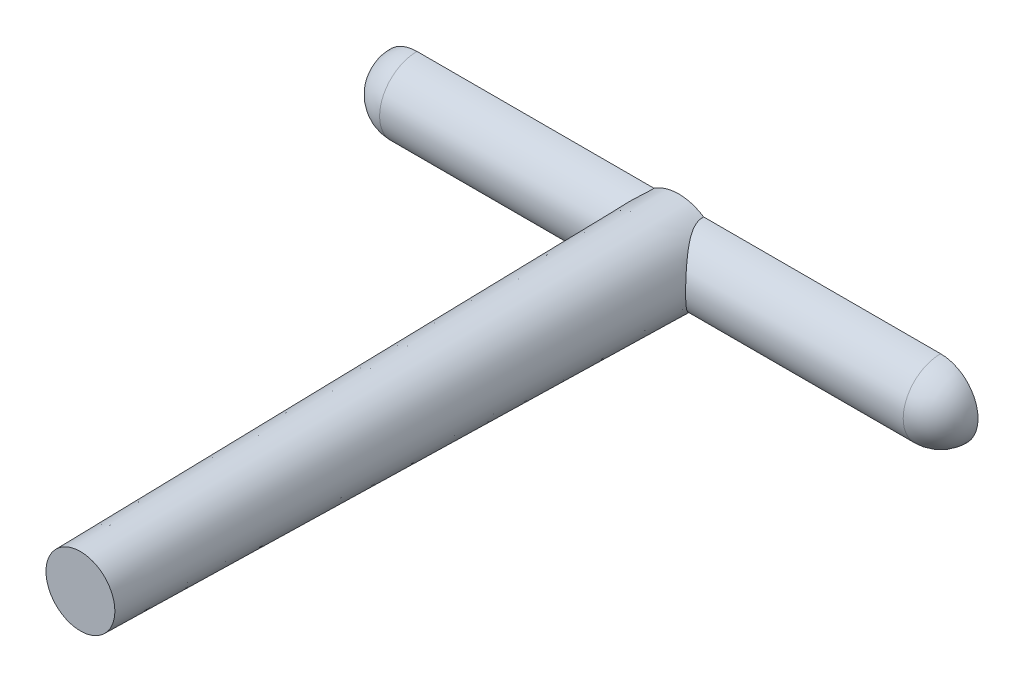
ISO-10303-21;
HEADER;
FILE_DESCRIPTION(('STEP AP214'),'2;1');
FILE_NAME('part.step','',(''),(''),'','','');
FILE_SCHEMA(('AUTOMOTIVE_DESIGN { 1 0 10303 214 1 1 1 1 }'));
ENDSEC;
DATA;
#1=APPLICATION_CONTEXT('core data for automotive mechanical design processes');
#2=APPLICATION_PROTOCOL_DEFINITION('international standard','automotive_design',2000,#1);
#3=PRODUCT_CONTEXT('',#1,'mechanical');
#4=PRODUCT('Part','Part','',(#3));
#5=PRODUCT_RELATED_PRODUCT_CATEGORY('part','',(#4));
#6=PRODUCT_DEFINITION_FORMATION('','',#4);
#7=PRODUCT_DEFINITION_CONTEXT('part definition',#1,'design');
#8=PRODUCT_DEFINITION('design','',#6,#7);
#9=PRODUCT_DEFINITION_SHAPE('','',#8);
#10=(LENGTH_UNIT() NAMED_UNIT(*) SI_UNIT(.MILLI.,.METRE.));
#11=(NAMED_UNIT(*) PLANE_ANGLE_UNIT() SI_UNIT($,.RADIAN.));
#12=(NAMED_UNIT(*) SI_UNIT($,.STERADIAN.) SOLID_ANGLE_UNIT());
#13=UNCERTAINTY_MEASURE_WITH_UNIT(LENGTH_MEASURE(1.E-05),#10,'distance_accuracy_value','');
#14=(GEOMETRIC_REPRESENTATION_CONTEXT(3) GLOBAL_UNCERTAINTY_ASSIGNED_CONTEXT((#13)) GLOBAL_UNIT_ASSIGNED_CONTEXT((#10,
#11,#12)) REPRESENTATION_CONTEXT('',''));
#15=CARTESIAN_POINT('',(0.,0.,0.));
#16=DIRECTION('',(0.,0.,1.));
#17=DIRECTION('',(1.,0.,0.));
#18=AXIS2_PLACEMENT_3D('',#15,#16,#17);
#19=CARTESIAN_POINT('',(-20.,0.,0.));
#20=DIRECTION('',(-1.,0.,0.));
#21=DIRECTION('',(0.,0.,1.));
#22=AXIS2_PLACEMENT_3D('',#19,#20,#21);
#23=CYLINDRICAL_SURFACE('',#22,2.5);
#24=DIRECTION('',(-1.,0.,0.));
#25=VECTOR('',#24,1.);
#26=CARTESIAN_POINT('',(-17.5,2.5,0.));
#27=LINE('',#26,#25);
#28=CARTESIAN_POINT('',(17.5,2.5,0.));
#29=VERTEX_POINT('',#28);
#30=CARTESIAN_POINT('',(1.6583123951777,2.5,0.));
#31=VERTEX_POINT('',#30);
#32=EDGE_CURVE('E87',#29,#31,#27,.T.);
#33=ORIENTED_EDGE('',*,*,#32,.T.);
#34=CARTESIAN_POINT('',(1.65831872270987,2.499999992,-0.000200000000008569));
#35=CARTESIAN_POINT('',(1.65691118249,2.50001367790751,0.0432280953647116));
#36=CARTESIAN_POINT('',(1.6572680105417,2.49887575801698,0.0866986855988901));
#37=CARTESIAN_POINT('',(1.66133995127769,2.49435998844086,0.17329522024137));
#38=CARTESIAN_POINT('',(1.66504949707968,2.49098585426137,0.216421616445954));
#39=CARTESIAN_POINT('',(1.67557460753311,2.48212646052389,0.301414449555393));
#40=CARTESIAN_POINT('',(1.68234351262531,2.47667310077305,0.343290088019334));
#41=CARTESIAN_POINT('',(1.69864828692563,2.46376197565381,0.426191073349026));
#42=CARTESIAN_POINT('',(1.70818543719791,2.45630328239289,0.467216017098571));
#43=CARTESIAN_POINT('',(1.74819791750787,2.42498377341643,0.618198648149621));
#44=CARTESIAN_POINT('',(1.78639727672917,2.39503553920176,0.724897365333699));
#45=CARTESIAN_POINT('',(1.87333411642033,2.32306936689233,0.930242509286194));
#46=CARTESIAN_POINT('',(1.92215514064034,2.28095482175718,1.02881602972014));
#47=CARTESIAN_POINT('',(2.01175982296458,2.19794688345456,1.19383419930235));
#48=CARTESIAN_POINT('',(2.05145221649262,2.15943992723876,1.26209814447758));
#49=CARTESIAN_POINT('',(2.13206522286415,2.07658836732887,1.39422719274052));
#50=CARTESIAN_POINT('',(2.17298640556665,2.03224102180182,1.458090208181));
#51=CARTESIAN_POINT('',(2.29551214072279,1.8907325793802,1.64292243148715));
#52=CARTESIAN_POINT('',(2.37709940614192,1.78491308172792,1.75751337482337));
#53=CARTESIAN_POINT('',(2.51776005886753,1.57201669479869,1.94813944408979));
#54=CARTESIAN_POINT('',(2.57822060181856,1.46871700479609,2.02739246784389));
#55=CARTESIAN_POINT('',(2.68951873970945,1.24734265076505,2.17058563244521));
#56=CARTESIAN_POINT('',(2.7403712338693,1.1292913423902,2.23454952370517));
#57=CARTESIAN_POINT('',(2.82027718493247,0.902750011902698,2.33397522564415));
#58=CARTESIAN_POINT('',(2.85161244641345,0.796418238795884,2.37250380106028));
#59=CARTESIAN_POINT('',(2.90285607376501,0.576939619557313,2.43518672846476));
#60=CARTESIAN_POINT('',(2.92277132286326,0.46379692414038,2.45934973938848));
#61=CARTESIAN_POINT('',(2.94958978318102,0.233171577968537,2.49183548251511));
#62=CARTESIAN_POINT('',(2.95643364806433,0.11567159073321,2.50008597077669));
#63=CARTESIAN_POINT('',(2.95628993477217,-0.119303831552891,2.49991271002276));
#64=CARTESIAN_POINT('',(2.94930377538985,-0.236779267885816,2.49149067140677));
#65=CARTESIAN_POINT('',(2.92315770351545,-0.459373811534688,2.45981622928826));
#66=CARTESIAN_POINT('',(2.90492381425137,-0.564768864279865,2.43769145737232));
#67=CARTESIAN_POINT('',(2.85847104219434,-0.769789227038972,2.38091360073576));
#68=CARTESIAN_POINT('',(2.83024948749581,-0.869412984805761,2.34625716348336));
#69=CARTESIAN_POINT('',(2.76300119186477,-1.06879945839087,2.26279926832524));
#70=CARTESIAN_POINT('',(2.72329711290839,-1.16795174649301,2.21309683717941));
#71=CARTESIAN_POINT('',(2.63663300693698,-1.3564903358799,2.10282626051992));
#72=CARTESIAN_POINT('',(2.58967042437517,-1.44587317858006,2.04225428688419));
#73=CARTESIAN_POINT('',(2.48068506226057,-1.63165737210345,1.89846678323049));
#74=CARTESIAN_POINT('',(2.41754413765634,-1.72577260834879,1.81315260002529));
#75=CARTESIAN_POINT('',(2.28794746955093,-1.89922848537495,1.63059059265366));
#76=CARTESIAN_POINT('',(2.22148625637457,-1.97854365475852,1.53332266415105));
#77=CARTESIAN_POINT('',(2.08895298151238,-2.12312279042065,1.32610667602634));
#78=CARTESIAN_POINT('',(2.02289825159191,-2.18818286499066,1.21600531990537));
#79=CARTESIAN_POINT('',(1.89867040107998,-2.30203515173958,0.983526981993171));
#80=CARTESIAN_POINT('',(1.84048066580649,-2.35086198554801,0.861176859053623));
#81=CARTESIAN_POINT('',(1.76111563078384,-2.41492846886666,0.652043012371417));
#82=CARTESIAN_POINT('',(1.7342532709581,-2.43589221653652,0.569214845551105));
#83=CARTESIAN_POINT('',(1.69144666063516,-2.46941126033992,0.39928828276785));
#84=CARTESIAN_POINT('',(1.67545734022662,-2.482001261726,0.312209137895455));
#85=CARTESIAN_POINT('',(1.66253133338179,-2.49327864477955,0.18697585559325));
#86=CARTESIAN_POINT('',(1.65992342778749,-2.49579493355285,0.149688559735348));
#87=CARTESIAN_POINT('',(1.65721440442096,-2.49916029358023,0.0748605178466163));
#88=CARTESIAN_POINT('',(1.65711921496037,-2.50000541767438,0.0373193814173753));
#89=CARTESIAN_POINT('',(1.65831872270987,-2.499999992,-0.000200000000008557));
#90=B_SPLINE_CURVE_WITH_KNOTS('',3,(#34,#35,#36,#37,#38,#39,#40,#41,#42,#43,#44,#45,#46,#47,#48,
#49,#50,#51,#52,#53,#54,#55,#56,#57,#58,#59,#60,#61,#62,#63,#64,#65,#66,#67,#68,#69,#70,#71,#72,
#73,#74,#75,#76,#77,#78,#79,#80,#81,#82,#83,#84,#85,#86,#87,#88,#89),.UNSPECIFIED.,.F.,.F.,(4,2,
2,2,2,2,2,2,2,2,2,2,2,2,2,2,2,2,2,2,2,2,2,2,2,2,2,4),(0.,0.130280559238331,0.260345196086631,
0.388489813216017,0.516693826789701,0.866214050136784,1.21858975022564,1.48182003813121,
1.74517434577148,2.27046433652363,2.69958282044793,3.12803030763972,3.47865351781732,
3.82906517279379,4.18106400997754,4.53302673821109,4.85929325267652,5.18564711619505,
5.53777568645139,5.89002851642059,6.31411859810577,6.73893195331289,7.1694736056813,
7.59909103509935,7.86693547064346,8.13366278194129,8.24594510909374,8.35849232302547),.UNSPECIFIED.);
#91=CARTESIAN_POINT('',(1.6583123951777,-2.5,0.));
#92=VERTEX_POINT('',#91);
#93=EDGE_CURVE('E59',#31,#92,#90,.T.);
#94=ORIENTED_EDGE('',*,*,#93,.T.);
#95=DIRECTION('',(-1.,0.,0.));
#96=VECTOR('',#95,1.);
#97=CARTESIAN_POINT('',(-17.5,-2.5,0.));
#98=LINE('',#97,#96);
#99=CARTESIAN_POINT('',(17.5,-2.5,0.));
#100=VERTEX_POINT('',#99);
#101=EDGE_CURVE('E127',#100,#92,#98,.T.);
#102=ORIENTED_EDGE('',*,*,#101,.F.);
#103=CARTESIAN_POINT('',(17.5,0.,0.));
#104=DIRECTION('',(-1.,0.,0.));
#105=DIRECTION('',(0.,0.,1.));
#106=AXIS2_PLACEMENT_3D('',#103,#104,#105);
#107=CIRCLE('',#106,2.5);
#108=EDGE_CURVE('E11',#100,#29,#107,.T.);
#109=ORIENTED_EDGE('',*,*,#108,.T.);
#110=EDGE_LOOP('',(#33,#94,#102,#109));
#111=FACE_BOUND('',#110,.T.);
#112=ADVANCED_FACE('F36',(#111),#23,.T.);
#113=CARTESIAN_POINT('',(-17.5,0.,0.));
#114=DIRECTION('',(-1.,0.,0.));
#115=DIRECTION('',(0.,-1.,0.));
#116=AXIS2_PLACEMENT_3D('',#113,#114,#115);
#117=SPHERICAL_SURFACE('',#116,2.5);
#118=CARTESIAN_POINT('',(-17.5,0.,0.));
#119=DIRECTION('',(-1.,0.,0.));
#120=DIRECTION('',(0.,0.,1.));
#121=AXIS2_PLACEMENT_3D('',#118,#119,#120);
#122=CIRCLE('',#121,2.5);
#123=CARTESIAN_POINT('',(-17.5,-2.5,0.));
#124=VERTEX_POINT('',#123);
#125=CARTESIAN_POINT('',(-17.5,2.5,0.));
#126=VERTEX_POINT('',#125);
#127=EDGE_CURVE('E44',#124,#126,#122,.T.);
#128=ORIENTED_EDGE('',*,*,#127,.T.);
#129=CARTESIAN_POINT('',(-17.5,0.,0.));
#130=DIRECTION('',(0.,0.,-1.));
#131=DIRECTION('',(1.,0.,0.));
#132=AXIS2_PLACEMENT_3D('',#129,#130,#131);
#133=CIRCLE('',#132,2.5);
#134=EDGE_CURVE('E85',#124,#126,#133,.T.);
#135=ORIENTED_EDGE('',*,*,#134,.F.);
#136=EDGE_LOOP('',(#128,#135));
#137=FACE_BOUND('',#136,.T.);
#138=ADVANCED_FACE('F119',(#137),#117,.T.);
#139=CARTESIAN_POINT('',(17.5,0.,0.));
#140=DIRECTION('',(-1.,0.,0.));
#141=DIRECTION('',(0.,-1.,0.));
#142=AXIS2_PLACEMENT_3D('',#139,#140,#141);
#143=SPHERICAL_SURFACE('',#142,2.5);
#144=ORIENTED_EDGE('',*,*,#108,.F.);
#145=CARTESIAN_POINT('',(17.5,0.,0.));
#146=DIRECTION('',(0.,0.,-1.));
#147=DIRECTION('',(-1.,0.,0.));
#148=AXIS2_PLACEMENT_3D('',#145,#146,#147);
#149=CIRCLE('',#148,2.5);
#150=EDGE_CURVE('E130',#29,#100,#149,.T.);
#151=ORIENTED_EDGE('',*,*,#150,.F.);
#152=EDGE_LOOP('',(#144,#151));
#153=FACE_BOUND('',#152,.T.);
#154=ADVANCED_FACE('F38',(#153),#143,.T.);
#155=CARTESIAN_POINT('',(-1.6583123951777,-2.5,0.));
#156=VERTEX_POINT('',#155);
#157=EDGE_CURVE('E51',#156,#124,#98,.T.);
#158=ORIENTED_EDGE('',*,*,#157,.F.);
#159=CARTESIAN_POINT('',(-1.65831872270987,-2.499999992,-0.000200000000008579));
#160=CARTESIAN_POINT('',(-1.65691118249,-2.50001367790751,0.0432280953647124));
#161=CARTESIAN_POINT('',(-1.6572680105417,-2.49887575801698,0.0866986855988918));
#162=CARTESIAN_POINT('',(-1.66133995127769,-2.49435998844086,0.173295220241373));
#163=CARTESIAN_POINT('',(-1.66504949707969,-2.49098585426137,0.216421616445958));
#164=CARTESIAN_POINT('',(-1.67557460753311,-2.48212646052389,0.301414449555398));
#165=CARTESIAN_POINT('',(-1.68234351262532,-2.47667310077305,0.34329008801934));
#166=CARTESIAN_POINT('',(-1.69864828692564,-2.46376197565381,0.426191073349034));
#167=CARTESIAN_POINT('',(-1.70818543719792,-2.45630328239289,0.467216017098579));
#168=CARTESIAN_POINT('',(-1.74819791750788,-2.42498377341643,0.618198648149633));
#169=CARTESIAN_POINT('',(-1.78639727672919,-2.39503553920175,0.724897365333714));
#170=CARTESIAN_POINT('',(-1.87333411642035,-2.32306936689232,0.930242509286215));
#171=CARTESIAN_POINT('',(-1.92215514064037,-2.28095482175717,1.02881602972017));
#172=CARTESIAN_POINT('',(-2.01175982296461,-2.19794688345454,1.19383419930238));
#173=CARTESIAN_POINT('',(-2.05145221649266,-2.15943992723875,1.2620981444776));
#174=CARTESIAN_POINT('',(-2.13206522286418,-2.07658836732886,1.39422719274054));
#175=CARTESIAN_POINT('',(-2.17298640556668,-2.0322410218018,1.45809020818102));
#176=CARTESIAN_POINT('',(-2.29551214072282,-1.89073257938018,1.64292243148718));
#177=CARTESIAN_POINT('',(-2.37709940614195,-1.7849130817279,1.7575133748234));
#178=CARTESIAN_POINT('',(-2.51776005886756,-1.57201669479866,1.94813944408982));
#179=CARTESIAN_POINT('',(-2.57822060181859,-1.46871700479606,2.02739246784391));
#180=CARTESIAN_POINT('',(-2.68951873970947,-1.24734265076503,2.17058563244522));
#181=CARTESIAN_POINT('',(-2.74037123386932,-1.12929134239017,2.23454952370519));
#182=CARTESIAN_POINT('',(-2.82027718493248,-0.902750011902677,2.33397522564416));
#183=CARTESIAN_POINT('',(-2.85161244641346,-0.796418238795863,2.37250380106029));
#184=CARTESIAN_POINT('',(-2.90285607376502,-0.576939619557294,2.43518672846477));
#185=CARTESIAN_POINT('',(-2.92277132286327,-0.46379692414036,2.45934973938848));
#186=CARTESIAN_POINT('',(-2.94958978318102,-0.23317157796852,2.49183548251511));
#187=CARTESIAN_POINT('',(-2.95643364806433,-0.115671590733193,2.50008597077669));
#188=CARTESIAN_POINT('',(-2.95628993477217,0.119303831552905,2.49991271002276));
#189=CARTESIAN_POINT('',(-2.94930377538985,0.236779267885829,2.49149067140677));
#190=CARTESIAN_POINT('',(-2.92315770351544,0.459373811534698,2.45981622928826));
#191=CARTESIAN_POINT('',(-2.90492381425136,0.564768864279875,2.43769145737231));
#192=CARTESIAN_POINT('',(-2.85847104219433,0.769789227038981,2.38091360073576));
#193=CARTESIAN_POINT('',(-2.83024948749579,0.869412984805769,2.34625716348336));
#194=CARTESIAN_POINT('',(-2.76300119186476,1.06879945839087,2.26279926832524));
#195=CARTESIAN_POINT('',(-2.72329711290837,1.16795174649302,2.21309683717941));
#196=CARTESIAN_POINT('',(-2.63663300693696,1.35649033587991,2.10282626051991));
#197=CARTESIAN_POINT('',(-2.58967042437514,1.44587317858007,2.04225428688419));
#198=CARTESIAN_POINT('',(-2.48068506226055,1.63165737210346,1.89846678323048));
#199=CARTESIAN_POINT('',(-2.41754413765631,1.7257726083488,1.81315260002528));
#200=CARTESIAN_POINT('',(-2.2879474695509,1.89922848537496,1.63059059265365));
#201=CARTESIAN_POINT('',(-2.22148625637454,1.97854365475853,1.53332266415104));
#202=CARTESIAN_POINT('',(-2.08895298151235,2.12312279042066,1.32610667602633));
#203=CARTESIAN_POINT('',(-2.02289825159189,2.18818286499066,1.21600531990536));
#204=CARTESIAN_POINT('',(-1.89867040107996,2.30203515173958,0.983526981993169));
#205=CARTESIAN_POINT('',(-1.84048066580648,2.35086198554801,0.861176859053626));
#206=CARTESIAN_POINT('',(-1.76111563078383,2.41492846886666,0.652043012371426));
#207=CARTESIAN_POINT('',(-1.7342532709581,2.43589221653651,0.569214845551116));
#208=CARTESIAN_POINT('',(-1.69144666063516,2.46941126033992,0.399288282767863));
#209=CARTESIAN_POINT('',(-1.67545734022662,2.482001261726,0.31220913789547));
#210=CARTESIAN_POINT('',(-1.66253133338179,2.49327864477955,0.186975855593263));
#211=CARTESIAN_POINT('',(-1.65992342778749,2.49579493355285,0.149688559735359));
#212=CARTESIAN_POINT('',(-1.65721440442096,2.49916029358023,0.0748605178466215));
#213=CARTESIAN_POINT('',(-1.65711921496037,2.50000541767438,0.037319381417378));
#214=CARTESIAN_POINT('',(-1.65831872270987,2.499999992,-0.000200000000008582));
#215=B_SPLINE_CURVE_WITH_KNOTS('',3,(#159,#160,#161,#162,#163,#164,#165,#166,#167,#168,#169,
#170,#171,#172,#173,#174,#175,#176,#177,#178,#179,#180,#181,#182,#183,#184,#185,#186,#187,#188,
#189,#190,#191,#192,#193,#194,#195,#196,#197,#198,#199,#200,#201,#202,#203,#204,#205,#206,#207,
#208,#209,#210,#211,#212,#213,#214),.UNSPECIFIED.,.F.,.F.,(4,2,2,2,2,2,2,2,2,2,2,2,2,2,2,2,2,2,
2,2,2,2,2,2,2,2,2,4),(0.,0.130280559238334,0.260345196086636,0.388489813216024,
0.516693826789711,0.866214050136807,1.21858975022568,1.48182003813125,1.74517434577152,
2.27046433652368,2.69958282044797,3.12803030763975,3.47865351781734,3.82906517279381,
4.18106400997756,4.5330267382111,4.85929325267653,5.18564711619507,5.5377756864514,
5.8900285164206,6.31411859810579,6.73893195331292,7.16947360568131,7.59909103509935,
7.86693547064345,8.13366278194127,8.24594510909374,8.35849232302547),.UNSPECIFIED.);
#216=CARTESIAN_POINT('',(-1.6583123951777,2.5,0.));
#217=VERTEX_POINT('',#216);
#218=EDGE_CURVE('E89',#156,#217,#215,.T.);
#219=ORIENTED_EDGE('',*,*,#218,.T.);
#220=EDGE_CURVE('E79',#217,#126,#27,.T.);
#221=ORIENTED_EDGE('',*,*,#220,.T.);
#222=ORIENTED_EDGE('',*,*,#127,.F.);
#223=EDGE_LOOP('',(#158,#219,#221,#222));
#224=FACE_BOUND('',#223,.T.);
#225=ADVANCED_FACE('F90',(#224),#23,.T.);
#226=CARTESIAN_POINT('',(-17.5,0.,0.));
#227=DIRECTION('',(0.,0.,-1.));
#228=DIRECTION('',(1.,0.,0.));
#229=AXIS2_PLACEMENT_3D('',#226,#227,#228);
#230=PLANE('',#229);
#231=ORIENTED_EDGE('',*,*,#220,.F.);
#232=CARTESIAN_POINT('',(0.,0.,0.));
#233=DIRECTION('',(0.,0.,-1.));
#234=DIRECTION('',(0.,1.,0.));
#235=AXIS2_PLACEMENT_3D('',#232,#233,#234);
#236=CIRCLE('',#235,3.);
#237=EDGE_CURVE('E83',#217,#31,#236,.T.);
#238=ORIENTED_EDGE('',*,*,#237,.T.);
#239=ORIENTED_EDGE('',*,*,#32,.F.);
#240=ORIENTED_EDGE('',*,*,#150,.T.);
#241=ORIENTED_EDGE('',*,*,#101,.T.);
#242=EDGE_CURVE('E97',#92,#156,#236,.T.);
#243=ORIENTED_EDGE('',*,*,#242,.T.);
#244=ORIENTED_EDGE('',*,*,#157,.T.);
#245=ORIENTED_EDGE('',*,*,#134,.T.);
#246=EDGE_LOOP('',(#231,#238,#239,#240,#241,#243,#244,#245));
#247=FACE_BOUND('',#246,.T.);
#248=ADVANCED_FACE('F80',(#247),#230,.T.);
#249=CARTESIAN_POINT('',(0.,0.,0.));
#250=DIRECTION('',(0.,0.,-1.));
#251=DIRECTION('',(0.,1.,0.));
#252=AXIS2_PLACEMENT_3D('',#249,#250,#251);
#253=CONICAL_SURFACE('',#252,3.,0.0174532925199433);
#254=CARTESIAN_POINT('',(0.,-2.79318507107451E-13,40.));
#255=DIRECTION('',(0.,0.,-1.));
#256=DIRECTION('',(0.,1.,0.));
#257=AXIS2_PLACEMENT_3D('',#254,#255,#256);
#258=CIRCLE('',#257,2.3017974028713);
#259=CARTESIAN_POINT('',(0.,2.30179740287102,40.));
#260=VERTEX_POINT('',#259);
#261=EDGE_CURVE('E94',#260,#260,#258,.T.);
#262=ORIENTED_EDGE('',*,*,#261,.T.);
#263=EDGE_LOOP('',(#262));
#264=FACE_BOUND('',#263,.T.);
#265=ORIENTED_EDGE('',*,*,#93,.F.);
#266=ORIENTED_EDGE('',*,*,#237,.F.);
#267=ORIENTED_EDGE('',*,*,#218,.F.);
#268=ORIENTED_EDGE('',*,*,#242,.F.);
#269=EDGE_LOOP('',(#265,#266,#267,#268));
#270=FACE_BOUND('',#269,.T.);
#271=ADVANCED_FACE('F96',(#264,#270),#253,.T.);
#272=CARTESIAN_POINT('',(0.,-2.79318507107451E-13,40.));
#273=DIRECTION('',(0.,0.,-1.));
#274=DIRECTION('',(0.,1.,0.));
#275=AXIS2_PLACEMENT_3D('',#272,#273,#274);
#276=PLANE('',#275);
#277=ORIENTED_EDGE('',*,*,#261,.F.);
#278=EDGE_LOOP('',(#277));
#279=FACE_BOUND('',#278,.T.);
#280=ADVANCED_FACE('F115',(#279),#276,.F.);
#281=CLOSED_SHELL('',(#112,#138,#154,#225,#248,#271,#280));
#282=MANIFOLD_SOLID_BREP('B2',#281);
#283=ADVANCED_BREP_SHAPE_REPRESENTATION('',(#18,#282),#14);
#284=SHAPE_DEFINITION_REPRESENTATION(#9,#283);
ENDSEC;
END-ISO-10303-21;
